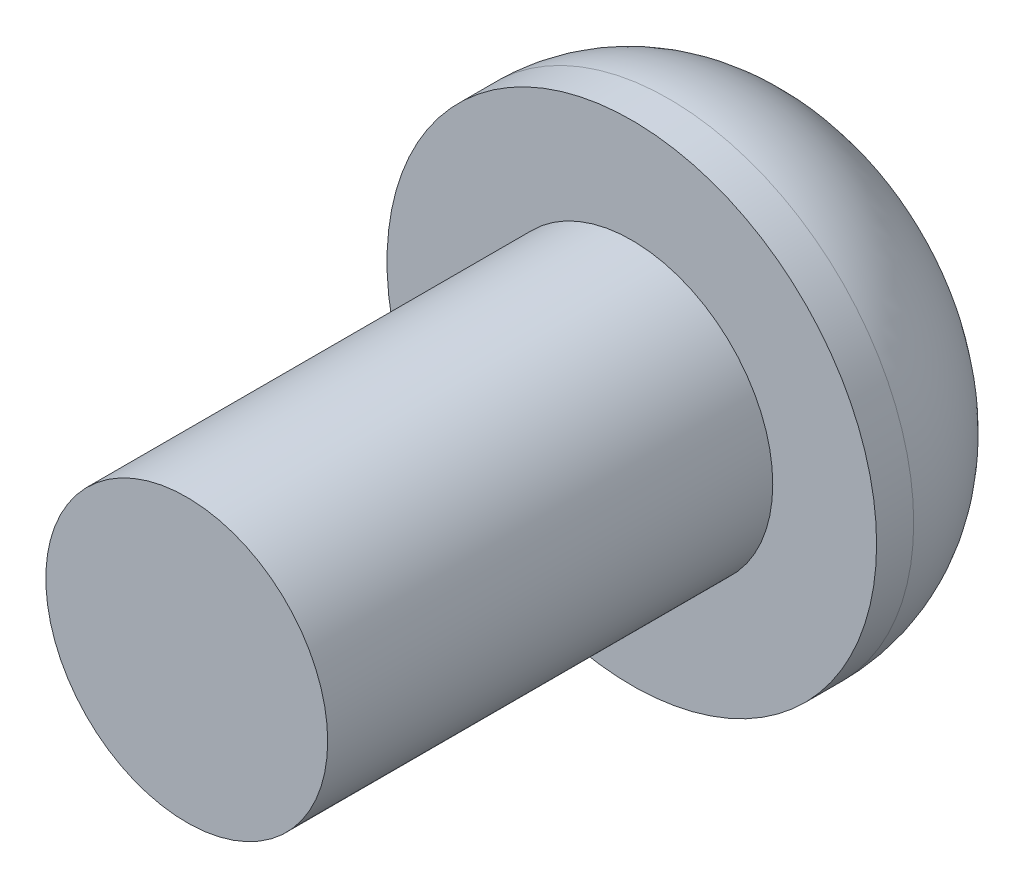
ISO-10303-21;
HEADER;
FILE_DESCRIPTION(('STEP AP214'),'2;1');
FILE_NAME('part.step','',(''),(''),'','','');
FILE_SCHEMA(('AUTOMOTIVE_DESIGN { 1 0 10303 214 1 1 1 1 }'));
ENDSEC;
DATA;
#1=APPLICATION_CONTEXT('core data for automotive mechanical design processes');
#2=APPLICATION_PROTOCOL_DEFINITION('international standard','automotive_design',2000,#1);
#3=PRODUCT_CONTEXT('',#1,'mechanical');
#4=PRODUCT('Part','Part','',(#3));
#5=PRODUCT_RELATED_PRODUCT_CATEGORY('part','',(#4));
#6=PRODUCT_DEFINITION_FORMATION('','',#4);
#7=PRODUCT_DEFINITION_CONTEXT('part definition',#1,'design');
#8=PRODUCT_DEFINITION('design','',#6,#7);
#9=PRODUCT_DEFINITION_SHAPE('','',#8);
#10=(LENGTH_UNIT() NAMED_UNIT(*) SI_UNIT(.MILLI.,.METRE.));
#11=(NAMED_UNIT(*) PLANE_ANGLE_UNIT() SI_UNIT($,.RADIAN.));
#12=(NAMED_UNIT(*) SI_UNIT($,.STERADIAN.) SOLID_ANGLE_UNIT());
#13=UNCERTAINTY_MEASURE_WITH_UNIT(LENGTH_MEASURE(1.E-05),#10,'distance_accuracy_value','');
#14=(GEOMETRIC_REPRESENTATION_CONTEXT(3) GLOBAL_UNCERTAINTY_ASSIGNED_CONTEXT((#13)) GLOBAL_UNIT_ASSIGNED_CONTEXT((#10,
#11,#12)) REPRESENTATION_CONTEXT('',''));
#15=CARTESIAN_POINT('',(0.,0.,0.));
#16=DIRECTION('',(0.,0.,1.));
#17=DIRECTION('',(1.,0.,0.));
#18=AXIS2_PLACEMENT_3D('',#15,#16,#17);
#19=CARTESIAN_POINT('',(0.,0.,1.05));
#20=DIRECTION('',(0.,0.,1.));
#21=DIRECTION('',(1.,0.,0.));
#22=AXIS2_PLACEMENT_3D('',#19,#20,#21);
#23=DEGENERATE_TOROIDAL_SURFACE('',#22,0.6,1.05,.T.);
#24=CARTESIAN_POINT('',(0.,0.,1.05));
#25=DIRECTION('',(0.,0.,1.));
#26=DIRECTION('',(1.,0.,0.));
#27=AXIS2_PLACEMENT_3D('',#24,#25,#26);
#28=CIRCLE('',#27,1.65);
#29=CARTESIAN_POINT('',(1.65,0.,1.05));
#30=VERTEX_POINT('',#29);
#31=EDGE_CURVE('E10',#30,#30,#28,.T.);
#32=ORIENTED_EDGE('',*,*,#31,.F.);
#33=EDGE_LOOP('',(#32));
#34=FACE_BOUND('',#33,.T.);
#35=CARTESIAN_POINT('',(0.,0.,0.0600505063388334));
#36=DIRECTION('',(0.,0.,1.));
#37=DIRECTION('',(1.,0.,0.));
#38=AXIS2_PLACEMENT_3D('',#35,#36,#37);
#39=CIRCLE('',#38,0.95);
#40=CARTESIAN_POINT('',(0.95,0.,0.0600505063388334));
#41=VERTEX_POINT('',#40);
#42=EDGE_CURVE('E35',#41,#41,#39,.T.);
#43=ORIENTED_EDGE('',*,*,#42,.T.);
#44=EDGE_LOOP('',(#43));
#45=FACE_BOUND('',#44,.T.);
#46=ADVANCED_FACE('F32',(#34,#45),#23,.T.);
#47=CARTESIAN_POINT('',(0.,0.,1.3));
#48=DIRECTION('',(0.,0.,-1.));
#49=DIRECTION('',(-1.,0.,0.));
#50=AXIS2_PLACEMENT_3D('',#47,#48,#49);
#51=CYLINDRICAL_SURFACE('',#50,1.65);
#52=ORIENTED_EDGE('',*,*,#31,.T.);
#53=EDGE_LOOP('',(#52));
#54=FACE_BOUND('',#53,.T.);
#55=CARTESIAN_POINT('',(0.,0.,1.3));
#56=DIRECTION('',(0.,0.,1.));
#57=DIRECTION('',(1.,0.,0.));
#58=AXIS2_PLACEMENT_3D('',#55,#56,#57);
#59=CIRCLE('',#58,1.65);
#60=CARTESIAN_POINT('',(1.65,0.,1.3));
#61=VERTEX_POINT('',#60);
#62=EDGE_CURVE('E43',#61,#61,#59,.T.);
#63=ORIENTED_EDGE('',*,*,#62,.F.);
#64=EDGE_LOOP('',(#63));
#65=FACE_BOUND('',#64,.T.);
#66=ADVANCED_FACE('F74',(#54,#65),#51,.T.);
#67=CARTESIAN_POINT('',(0.,0.,1.3));
#68=DIRECTION('',(0.,0.,1.));
#69=DIRECTION('',(1.,0.,0.));
#70=AXIS2_PLACEMENT_3D('',#67,#68,#69);
#71=PLANE('',#70);
#72=CARTESIAN_POINT('',(0.,0.,1.3));
#73=DIRECTION('',(0.,0.,1.));
#74=DIRECTION('',(1.,0.,0.));
#75=AXIS2_PLACEMENT_3D('',#72,#73,#74);
#76=CIRCLE('',#75,0.95);
#77=CARTESIAN_POINT('',(0.95,0.,1.3));
#78=VERTEX_POINT('',#77);
#79=EDGE_CURVE('E39',#78,#78,#76,.T.);
#80=ORIENTED_EDGE('',*,*,#79,.F.);
#81=EDGE_LOOP('',(#80));
#82=FACE_BOUND('',#81,.T.);
#83=ORIENTED_EDGE('',*,*,#62,.T.);
#84=EDGE_LOOP('',(#83));
#85=FACE_BOUND('',#84,.T.);
#86=ADVANCED_FACE('F79',(#82,#85),#71,.T.);
#87=CARTESIAN_POINT('',(0.,0.,4.3));
#88=DIRECTION('',(0.,0.,-1.));
#89=DIRECTION('',(-1.,0.,0.));
#90=AXIS2_PLACEMENT_3D('',#87,#88,#89);
#91=CYLINDRICAL_SURFACE('',#90,0.95);
#92=CARTESIAN_POINT('',(0.,0.,4.3));
#93=DIRECTION('',(0.,0.,1.));
#94=DIRECTION('',(1.,0.,0.));
#95=AXIS2_PLACEMENT_3D('',#92,#93,#94);
#96=CIRCLE('',#95,0.95);
#97=CARTESIAN_POINT('',(0.95,0.,4.3));
#98=VERTEX_POINT('',#97);
#99=EDGE_CURVE('E47',#98,#98,#96,.T.);
#100=ORIENTED_EDGE('',*,*,#99,.F.);
#101=EDGE_LOOP('',(#100));
#102=FACE_BOUND('',#101,.T.);
#103=ORIENTED_EDGE('',*,*,#79,.T.);
#104=EDGE_LOOP('',(#103));
#105=FACE_BOUND('',#104,.T.);
#106=ADVANCED_FACE('F70',(#102,#105),#91,.T.);
#107=CARTESIAN_POINT('',(0.,0.,4.3));
#108=DIRECTION('',(0.,0.,1.));
#109=DIRECTION('',(1.,0.,0.));
#110=AXIS2_PLACEMENT_3D('',#107,#108,#109);
#111=PLANE('',#110);
#112=ORIENTED_EDGE('',*,*,#99,.T.);
#113=EDGE_LOOP('',(#112));
#114=FACE_BOUND('',#113,.T.);
#115=ADVANCED_FACE('F62',(#114),#111,.T.);
#116=CARTESIAN_POINT('',(0.,0.,1.));
#117=DIRECTION('',(0.,0.,-1.));
#118=DIRECTION('',(-1.,0.,0.));
#119=AXIS2_PLACEMENT_3D('',#116,#117,#118);
#120=CYLINDRICAL_SURFACE('',#119,0.95);
#121=ORIENTED_EDGE('',*,*,#42,.F.);
#122=EDGE_LOOP('',(#121));
#123=FACE_BOUND('',#122,.T.);
#124=CARTESIAN_POINT('',(0.,0.,1.));
#125=DIRECTION('',(0.,0.,1.));
#126=DIRECTION('',(1.,0.,0.));
#127=AXIS2_PLACEMENT_3D('',#124,#125,#126);
#128=CIRCLE('',#127,0.95);
#129=CARTESIAN_POINT('',(0.95,0.,1.));
#130=VERTEX_POINT('',#129);
#131=EDGE_CURVE('E51',#130,#130,#128,.T.);
#132=ORIENTED_EDGE('',*,*,#131,.T.);
#133=EDGE_LOOP('',(#132));
#134=FACE_BOUND('',#133,.T.);
#135=ADVANCED_FACE('F59',(#123,#134),#120,.F.);
#136=CARTESIAN_POINT('',(0.,0.,1.));
#137=DIRECTION('',(0.,0.,1.));
#138=DIRECTION('',(1.,0.,0.));
#139=AXIS2_PLACEMENT_3D('',#136,#137,#138);
#140=PLANE('',#139);
#141=ORIENTED_EDGE('',*,*,#131,.F.);
#142=EDGE_LOOP('',(#141));
#143=FACE_BOUND('',#142,.T.);
#144=ADVANCED_FACE('F61',(#143),#140,.F.);
#145=CLOSED_SHELL('',(#46,#66,#86,#106,#115,#135,#144));
#146=MANIFOLD_SOLID_BREP('B2',#145);
#147=ADVANCED_BREP_SHAPE_REPRESENTATION('',(#18,#146),#14);
#148=SHAPE_DEFINITION_REPRESENTATION(#9,#147);
ENDSEC;
END-ISO-10303-21;
